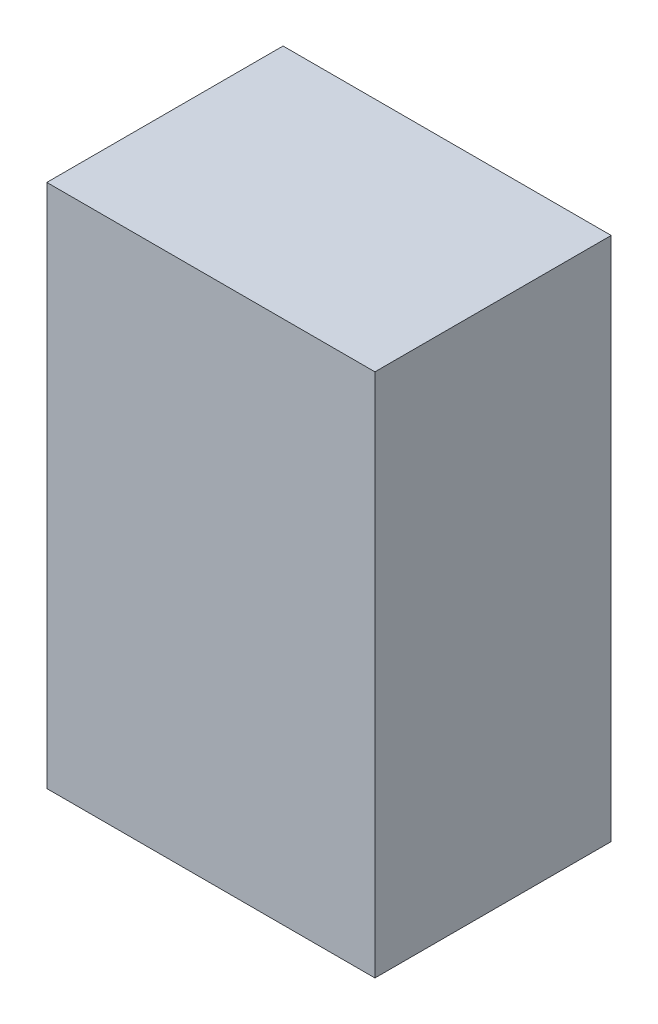
ISO-10303-21;
HEADER;
FILE_DESCRIPTION(('STEP AP214'),'2;1');
FILE_NAME('part.step','',(''),(''),'','','');
FILE_SCHEMA(('AUTOMOTIVE_DESIGN { 1 0 10303 214 1 1 1 1 }'));
ENDSEC;
DATA;
#1=APPLICATION_CONTEXT('core data for automotive mechanical design processes');
#2=APPLICATION_PROTOCOL_DEFINITION('international standard','automotive_design',2000,#1);
#3=PRODUCT_CONTEXT('',#1,'mechanical');
#4=PRODUCT('Part','Part','',(#3));
#5=PRODUCT_RELATED_PRODUCT_CATEGORY('part','',(#4));
#6=PRODUCT_DEFINITION_FORMATION('','',#4);
#7=PRODUCT_DEFINITION_CONTEXT('part definition',#1,'design');
#8=PRODUCT_DEFINITION('design','',#6,#7);
#9=PRODUCT_DEFINITION_SHAPE('','',#8);
#10=(LENGTH_UNIT() NAMED_UNIT(*) SI_UNIT(.MILLI.,.METRE.));
#11=(NAMED_UNIT(*) PLANE_ANGLE_UNIT() SI_UNIT($,.RADIAN.));
#12=(NAMED_UNIT(*) SI_UNIT($,.STERADIAN.) SOLID_ANGLE_UNIT());
#13=UNCERTAINTY_MEASURE_WITH_UNIT(LENGTH_MEASURE(1.E-05),#10,'distance_accuracy_value','');
#14=(GEOMETRIC_REPRESENTATION_CONTEXT(3) GLOBAL_UNCERTAINTY_ASSIGNED_CONTEXT((#13)) GLOBAL_UNIT_ASSIGNED_CONTEXT((#10,
#11,#12)) REPRESENTATION_CONTEXT('',''));
#15=CARTESIAN_POINT('',(0.,0.,0.));
#16=DIRECTION('',(0.,0.,1.));
#17=DIRECTION('',(1.,0.,0.));
#18=AXIS2_PLACEMENT_3D('',#15,#16,#17);
#19=CARTESIAN_POINT('',(-0.6250051,1.00000054,0.90000074));
#20=DIRECTION('',(0.,0.,1.));
#21=DIRECTION('',(1.,0.,0.));
#22=AXIS2_PLACEMENT_3D('',#19,#20,#21);
#23=PLANE('',#22);
#24=DIRECTION('',(1.27000253850325E-06,0.999999999999194,0.));
#25=VECTOR('',#24,1.);
#26=CARTESIAN_POINT('',(0.62500256,-0.99999546,0.90000074));
#27=LINE('',#26,#25);
#28=CARTESIAN_POINT('',(0.625002559993548,-1.00000054,0.90000074));
#29=VERTEX_POINT('',#28);
#30=CARTESIAN_POINT('',(0.625005099999999,1.00000054,0.90000074));
#31=VERTEX_POINT('',#30);
#32=EDGE_CURVE('E58',#29,#31,#27,.T.);
#33=ORIENTED_EDGE('',*,*,#32,.T.);
#34=DIRECTION('',(1.,0.,0.));
#35=VECTOR('',#34,1.);
#36=CARTESIAN_POINT('',(-0.6250051,1.00000054,0.90000074));
#37=LINE('',#36,#35);
#38=CARTESIAN_POINT('',(-0.625000020009677,1.00000054,0.90000074));
#39=VERTEX_POINT('',#38);
#40=EDGE_CURVE('E19',#31,#39,#37,.F.);
#41=ORIENTED_EDGE('',*,*,#40,.T.);
#42=DIRECTION('',(1.27000415141125E-06,-0.999999999999194,0.));
#43=VECTOR('',#42,1.);
#44=CARTESIAN_POINT('',(-0.62500002,0.99999292,0.90000074));
#45=LINE('',#44,#43);
#46=CARTESIAN_POINT('',(-0.624997480000002,-1.00000054,0.90000074));
#47=VERTEX_POINT('',#46);
#48=EDGE_CURVE('E55',#39,#47,#45,.T.);
#49=ORIENTED_EDGE('',*,*,#48,.T.);
#50=DIRECTION('',(1.,0.,0.));
#51=VECTOR('',#50,1.);
#52=CARTESIAN_POINT('',(-0.62499748,-1.00000054,0.90000074));
#53=LINE('',#52,#51);
#54=EDGE_CURVE('E77',#47,#29,#53,.T.);
#55=ORIENTED_EDGE('',*,*,#54,.T.);
#56=EDGE_LOOP('',(#33,#41,#49,#55));
#57=FACE_BOUND('',#56,.T.);
#58=ADVANCED_FACE('F16',(#57),#23,.T.);
#59=CARTESIAN_POINT('',(-0.62500002,0.99999292,0.));
#60=DIRECTION('',(0.999999999999194,1.27000415141125E-06,0.));
#61=DIRECTION('',(-1.27000415141125E-06,0.999999999999194,0.));
#62=AXIS2_PLACEMENT_3D('',#59,#60,#61);
#63=PLANE('',#62);
#64=DIRECTION('',(0.,0.,1.));
#65=VECTOR('',#64,1.);
#66=CARTESIAN_POINT('',(-0.62499748,-1.00000054,0.));
#67=LINE('',#66,#65);
#68=CARTESIAN_POINT('',(-0.624997480000002,-1.00000054,0.));
#69=VERTEX_POINT('',#68);
#70=EDGE_CURVE('E65',#69,#47,#67,.T.);
#71=ORIENTED_EDGE('',*,*,#70,.T.);
#72=ORIENTED_EDGE('',*,*,#48,.F.);
#73=DIRECTION('',(0.,0.,-1.));
#74=VECTOR('',#73,1.);
#75=CARTESIAN_POINT('',(-0.625000020009677,1.00000054,0.));
#76=LINE('',#75,#74);
#77=CARTESIAN_POINT('',(-0.625000020009677,1.00000054,0.));
#78=VERTEX_POINT('',#77);
#79=EDGE_CURVE('E64',#39,#78,#76,.T.);
#80=ORIENTED_EDGE('',*,*,#79,.T.);
#81=DIRECTION('',(-1.27000415141125E-06,0.999999999999194,0.));
#82=VECTOR('',#81,1.);
#83=CARTESIAN_POINT('',(-0.62500002,0.99999292,0.));
#84=LINE('',#83,#82);
#85=EDGE_CURVE('E67',#78,#69,#84,.F.);
#86=ORIENTED_EDGE('',*,*,#85,.T.);
#87=EDGE_LOOP('',(#71,#72,#80,#86));
#88=FACE_BOUND('',#87,.T.);
#89=ADVANCED_FACE('F62',(#88),#63,.F.);
#90=CARTESIAN_POINT('',(-0.62499748,-1.00000054,0.));
#91=DIRECTION('',(0.,1.,0.));
#92=DIRECTION('',(0.,0.,1.));
#93=AXIS2_PLACEMENT_3D('',#90,#91,#92);
#94=PLANE('',#93);
#95=DIRECTION('',(0.,0.,1.));
#96=VECTOR('',#95,1.);
#97=CARTESIAN_POINT('',(0.625002559993548,-1.00000054,0.));
#98=LINE('',#97,#96);
#99=CARTESIAN_POINT('',(0.625002559993548,-1.00000054,0.));
#100=VERTEX_POINT('',#99);
#101=EDGE_CURVE('E75',#100,#29,#98,.T.);
#102=ORIENTED_EDGE('',*,*,#101,.T.);
#103=ORIENTED_EDGE('',*,*,#54,.F.);
#104=ORIENTED_EDGE('',*,*,#70,.F.);
#105=DIRECTION('',(1.,0.,0.));
#106=VECTOR('',#105,1.);
#107=CARTESIAN_POINT('',(-0.6250051,-1.00000054,0.));
#108=LINE('',#107,#106);
#109=EDGE_CURVE('E69',#69,#100,#108,.T.);
#110=ORIENTED_EDGE('',*,*,#109,.T.);
#111=EDGE_LOOP('',(#102,#103,#104,#110));
#112=FACE_BOUND('',#111,.T.);
#113=ADVANCED_FACE('F87',(#112),#94,.F.);
#114=CARTESIAN_POINT('',(0.62500256,-0.99999546,0.));
#115=DIRECTION('',(-0.999999999999194,1.27000253850325E-06,0.));
#116=DIRECTION('',(-1.27000253850325E-06,-0.999999999999194,0.));
#117=AXIS2_PLACEMENT_3D('',#114,#115,#116);
#118=PLANE('',#117);
#119=DIRECTION('',(0.,0.,-1.));
#120=VECTOR('',#119,1.);
#121=CARTESIAN_POINT('',(0.6250051,1.00000054,0.));
#122=LINE('',#121,#120);
#123=CARTESIAN_POINT('',(0.625005099999999,1.00000054,0.));
#124=VERTEX_POINT('',#123);
#125=EDGE_CURVE('E33',#124,#31,#122,.F.);
#126=ORIENTED_EDGE('',*,*,#125,.T.);
#127=ORIENTED_EDGE('',*,*,#32,.F.);
#128=ORIENTED_EDGE('',*,*,#101,.F.);
#129=DIRECTION('',(-1.27000253850325E-06,-0.999999999999194,0.));
#130=VECTOR('',#129,1.);
#131=CARTESIAN_POINT('',(0.62500256,-0.99999546,0.));
#132=LINE('',#131,#130);
#133=EDGE_CURVE('E25',#100,#124,#132,.F.);
#134=ORIENTED_EDGE('',*,*,#133,.T.);
#135=EDGE_LOOP('',(#126,#127,#128,#134));
#136=FACE_BOUND('',#135,.T.);
#137=ADVANCED_FACE('F96',(#136),#118,.F.);
#138=CARTESIAN_POINT('',(0.6250051,1.00000054,0.));
#139=DIRECTION('',(0.,-1.,0.));
#140=DIRECTION('',(0.,0.,-1.));
#141=AXIS2_PLACEMENT_3D('',#138,#139,#140);
#142=PLANE('',#141);
#143=ORIENTED_EDGE('',*,*,#79,.F.);
#144=ORIENTED_EDGE('',*,*,#40,.F.);
#145=ORIENTED_EDGE('',*,*,#125,.F.);
#146=DIRECTION('',(1.,0.,0.));
#147=VECTOR('',#146,1.);
#148=CARTESIAN_POINT('',(0.6250051,1.00000054,0.));
#149=LINE('',#148,#147);
#150=EDGE_CURVE('E11',#124,#78,#149,.F.);
#151=ORIENTED_EDGE('',*,*,#150,.T.);
#152=EDGE_LOOP('',(#143,#144,#145,#151));
#153=FACE_BOUND('',#152,.T.);
#154=ADVANCED_FACE('F66',(#153),#142,.F.);
#155=CARTESIAN_POINT('',(-0.6250051,1.00000054,0.));
#156=DIRECTION('',(0.,0.,1.));
#157=DIRECTION('',(1.,0.,0.));
#158=AXIS2_PLACEMENT_3D('',#155,#156,#157);
#159=PLANE('',#158);
#160=ORIENTED_EDGE('',*,*,#133,.F.);
#161=ORIENTED_EDGE('',*,*,#109,.F.);
#162=ORIENTED_EDGE('',*,*,#85,.F.);
#163=ORIENTED_EDGE('',*,*,#150,.F.);
#164=EDGE_LOOP('',(#160,#161,#162,#163));
#165=FACE_BOUND('',#164,.T.);
#166=ADVANCED_FACE('F89',(#165),#159,.F.);
#167=CLOSED_SHELL('',(#58,#89,#113,#137,#154,#166));
#168=MANIFOLD_SOLID_BREP('B1',#167);
#169=ADVANCED_BREP_SHAPE_REPRESENTATION('',(#18,#168),#14);
#170=SHAPE_DEFINITION_REPRESENTATION(#9,#169);
ENDSEC;
END-ISO-10303-21;
